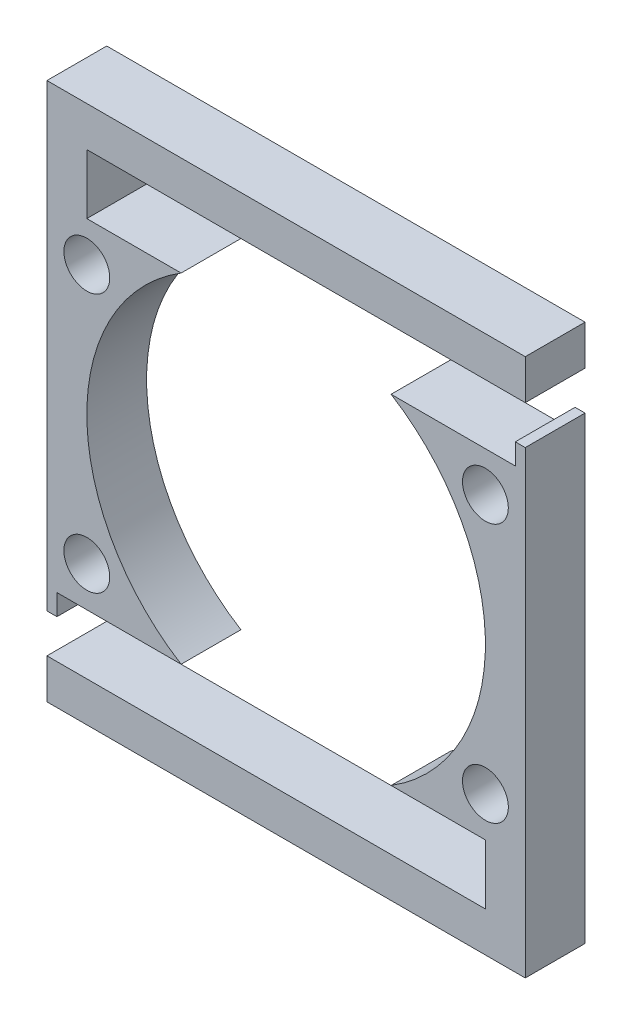
ISO-10303-21;
HEADER;
FILE_DESCRIPTION(('STEP AP214'),'2;1');
FILE_NAME('part.step','',(''),(''),'','','');
FILE_SCHEMA(('AUTOMOTIVE_DESIGN { 1 0 10303 214 1 1 1 1 }'));
ENDSEC;
DATA;
#1=APPLICATION_CONTEXT('core data for automotive mechanical design processes');
#2=APPLICATION_PROTOCOL_DEFINITION('international standard','automotive_design',2000,#1);
#3=PRODUCT_CONTEXT('',#1,'mechanical');
#4=PRODUCT('Part','Part','',(#3));
#5=PRODUCT_RELATED_PRODUCT_CATEGORY('part','',(#4));
#6=PRODUCT_DEFINITION_FORMATION('','',#4);
#7=PRODUCT_DEFINITION_CONTEXT('part definition',#1,'design');
#8=PRODUCT_DEFINITION('design','',#6,#7);
#9=PRODUCT_DEFINITION_SHAPE('','',#8);
#10=(LENGTH_UNIT() NAMED_UNIT(*) SI_UNIT(.MILLI.,.METRE.));
#11=(NAMED_UNIT(*) PLANE_ANGLE_UNIT() SI_UNIT($,.RADIAN.));
#12=(NAMED_UNIT(*) SI_UNIT($,.STERADIAN.) SOLID_ANGLE_UNIT());
#13=UNCERTAINTY_MEASURE_WITH_UNIT(LENGTH_MEASURE(1.E-05),#10,'distance_accuracy_value','');
#14=(GEOMETRIC_REPRESENTATION_CONTEXT(3) GLOBAL_UNCERTAINTY_ASSIGNED_CONTEXT((#13)) GLOBAL_UNIT_ASSIGNED_CONTEXT((#10,
#11,#12)) REPRESENTATION_CONTEXT('',''));
#15=CARTESIAN_POINT('',(0.,0.,0.));
#16=DIRECTION('',(0.,0.,1.));
#17=DIRECTION('',(1.,0.,0.));
#18=AXIS2_PLACEMENT_3D('',#15,#16,#17);
#19=CARTESIAN_POINT('',(0.,0.,3.));
#20=DIRECTION('',(0.,0.,1.));
#21=DIRECTION('',(1.,0.,0.));
#22=AXIS2_PLACEMENT_3D('',#19,#20,#21);
#23=PLANE('',#22);
#24=CARTESIAN_POINT('',(-10.,-6.5,3.));
#25=DIRECTION('',(0.,0.,1.));
#26=DIRECTION('',(1.,0.,0.));
#27=AXIS2_PLACEMENT_3D('',#24,#25,#26);
#28=CIRCLE('',#27,1.15);
#29=CARTESIAN_POINT('',(-8.85,-6.5,3.));
#30=VERTEX_POINT('',#29);
#31=EDGE_CURVE('E165',#30,#30,#28,.T.);
#32=ORIENTED_EDGE('',*,*,#31,.F.);
#33=EDGE_LOOP('',(#32));
#34=FACE_BOUND('',#33,.T.);
#35=DIRECTION('',(0.,1.,0.));
#36=VECTOR('',#35,1.);
#37=CARTESIAN_POINT('',(12.,11.5,3.));
#38=LINE('',#37,#36);
#39=CARTESIAN_POINT('',(12.,11.5,3.));
#40=VERTEX_POINT('',#39);
#41=CARTESIAN_POINT('',(12.,13.5,3.));
#42=VERTEX_POINT('',#41);
#43=EDGE_CURVE('E180',#40,#42,#38,.T.);
#44=ORIENTED_EDGE('',*,*,#43,.T.);
#45=DIRECTION('',(-1.,0.,0.));
#46=VECTOR('',#45,1.);
#47=CARTESIAN_POINT('',(-12.,13.5,3.));
#48=LINE('',#47,#46);
#49=CARTESIAN_POINT('',(-12.,13.5,3.));
#50=VERTEX_POINT('',#49);
#51=EDGE_CURVE('E104',#42,#50,#48,.T.);
#52=ORIENTED_EDGE('',*,*,#51,.T.);
#53=DIRECTION('',(0.,-1.,0.));
#54=VECTOR('',#53,1.);
#55=CARTESIAN_POINT('',(-12.,-8.5,3.));
#56=LINE('',#55,#54);
#57=CARTESIAN_POINT('',(-12.0000000000001,-9.54999999999992,3.));
#58=VERTEX_POINT('',#57);
#59=EDGE_CURVE('E176',#50,#58,#56,.T.);
#60=ORIENTED_EDGE('',*,*,#59,.T.);
#61=DIRECTION('',(1.,0.,0.));
#62=VECTOR('',#61,1.);
#63=CARTESIAN_POINT('',(-12.0000000000001,-9.54999999999992,3.));
#64=LINE('',#63,#62);
#65=CARTESIAN_POINT('',(-11.5000000000001,-9.54999999999992,3.));
#66=VERTEX_POINT('',#65);
#67=EDGE_CURVE('E268',#58,#66,#64,.T.);
#68=ORIENTED_EDGE('',*,*,#67,.T.);
#69=DIRECTION('',(0.,1.,0.));
#70=VECTOR('',#69,1.);
#71=CARTESIAN_POINT('',(-11.5000000000001,-9.54999999999992,3.));
#72=LINE('',#71,#70);
#73=CARTESIAN_POINT('',(-11.5000000000001,-8.49999999999992,3.));
#74=VERTEX_POINT('',#73);
#75=EDGE_CURVE('E266',#66,#74,#72,.T.);
#76=ORIENTED_EDGE('',*,*,#75,.T.);
#77=DIRECTION('',(1.,0.,0.));
#78=VECTOR('',#77,1.);
#79=CARTESIAN_POINT('',(-12.,-8.5,3.));
#80=LINE('',#79,#78);
#81=CARTESIAN_POINT('',(-5.26782687642636,-8.5,3.));
#82=VERTEX_POINT('',#81);
#83=EDGE_CURVE('E174',#74,#82,#80,.T.);
#84=ORIENTED_EDGE('',*,*,#83,.T.);
#85=CARTESIAN_POINT('',(0.,0.,3.));
#86=DIRECTION('',(0.,0.,-1.));
#87=DIRECTION('',(1.,0.,0.));
#88=AXIS2_PLACEMENT_3D('',#85,#86,#87);
#89=CIRCLE('',#88,10.);
#90=CARTESIAN_POINT('',(-5.26782687642637,8.5,3.));
#91=VERTEX_POINT('',#90);
#92=EDGE_CURVE('E145',#82,#91,#89,.T.);
#93=ORIENTED_EDGE('',*,*,#92,.T.);
#94=DIRECTION('',(-1.,0.,0.));
#95=VECTOR('',#94,1.);
#96=CARTESIAN_POINT('',(-10.,8.49999999999999,3.));
#97=LINE('',#96,#95);
#98=CARTESIAN_POINT('',(-10.,8.49999999999999,3.));
#99=VERTEX_POINT('',#98);
#100=EDGE_CURVE('E171',#91,#99,#97,.T.);
#101=ORIENTED_EDGE('',*,*,#100,.T.);
#102=DIRECTION('',(0.,1.,0.));
#103=VECTOR('',#102,1.);
#104=CARTESIAN_POINT('',(-10.,11.5,3.));
#105=LINE('',#104,#103);
#106=CARTESIAN_POINT('',(-10.,11.5,3.));
#107=VERTEX_POINT('',#106);
#108=EDGE_CURVE('E168',#99,#107,#105,.T.);
#109=ORIENTED_EDGE('',*,*,#108,.T.);
#110=DIRECTION('',(1.,0.,0.));
#111=VECTOR('',#110,1.);
#112=CARTESIAN_POINT('',(12.,11.5,3.));
#113=LINE('',#112,#111);
#114=EDGE_CURVE('E166',#107,#40,#113,.T.);
#115=ORIENTED_EDGE('',*,*,#114,.T.);
#116=EDGE_LOOP('',(#44,#52,#60,#68,#76,#84,#93,#101,#109,#115));
#117=FACE_BOUND('',#116,.T.);
#118=CARTESIAN_POINT('',(-10.,6.5,3.));
#119=DIRECTION('',(0.,0.,1.));
#120=DIRECTION('',(-1.,0.,0.));
#121=AXIS2_PLACEMENT_3D('',#118,#119,#120);
#122=CIRCLE('',#121,1.15);
#123=CARTESIAN_POINT('',(-11.15,6.5,3.));
#124=VERTEX_POINT('',#123);
#125=EDGE_CURVE('E55',#124,#124,#122,.T.);
#126=ORIENTED_EDGE('',*,*,#125,.F.);
#127=EDGE_LOOP('',(#126));
#128=FACE_BOUND('',#127,.T.);
#129=ADVANCED_FACE('F51',(#34,#117,#128),#23,.T.);
#130=CARTESIAN_POINT('',(0.,0.,0.));
#131=DIRECTION('',(0.,0.,1.));
#132=DIRECTION('',(1.,0.,0.));
#133=AXIS2_PLACEMENT_3D('',#130,#131,#132);
#134=PLANE('',#133);
#135=DIRECTION('',(0.,1.,0.));
#136=VECTOR('',#135,1.);
#137=CARTESIAN_POINT('',(12.,11.5,0.));
#138=LINE('',#137,#136);
#139=CARTESIAN_POINT('',(12.,11.5,0.));
#140=VERTEX_POINT('',#139);
#141=CARTESIAN_POINT('',(12.,13.5,0.));
#142=VERTEX_POINT('',#141);
#143=EDGE_CURVE('E162',#140,#142,#138,.T.);
#144=ORIENTED_EDGE('',*,*,#143,.F.);
#145=DIRECTION('',(1.,0.,0.));
#146=VECTOR('',#145,1.);
#147=CARTESIAN_POINT('',(12.,11.5,0.));
#148=LINE('',#147,#146);
#149=CARTESIAN_POINT('',(-10.,11.5,0.));
#150=VERTEX_POINT('',#149);
#151=EDGE_CURVE('E113',#150,#140,#148,.T.);
#152=ORIENTED_EDGE('',*,*,#151,.F.);
#153=DIRECTION('',(0.,1.,0.));
#154=VECTOR('',#153,1.);
#155=CARTESIAN_POINT('',(-10.,11.5,0.));
#156=LINE('',#155,#154);
#157=CARTESIAN_POINT('',(-10.,8.49999999999999,0.));
#158=VERTEX_POINT('',#157);
#159=EDGE_CURVE('E155',#158,#150,#156,.T.);
#160=ORIENTED_EDGE('',*,*,#159,.F.);
#161=DIRECTION('',(-1.,0.,0.));
#162=VECTOR('',#161,1.);
#163=CARTESIAN_POINT('',(-10.,8.49999999999999,0.));
#164=LINE('',#163,#162);
#165=CARTESIAN_POINT('',(-5.26782687642637,8.5,0.));
#166=VERTEX_POINT('',#165);
#167=EDGE_CURVE('E153',#166,#158,#164,.T.);
#168=ORIENTED_EDGE('',*,*,#167,.F.);
#169=CARTESIAN_POINT('',(0.,0.,0.));
#170=DIRECTION('',(0.,0.,-1.));
#171=DIRECTION('',(1.,0.,0.));
#172=AXIS2_PLACEMENT_3D('',#169,#170,#171);
#173=CIRCLE('',#172,10.);
#174=CARTESIAN_POINT('',(-5.26782687642636,-8.5,0.));
#175=VERTEX_POINT('',#174);
#176=EDGE_CURVE('E139',#175,#166,#173,.T.);
#177=ORIENTED_EDGE('',*,*,#176,.F.);
#178=DIRECTION('',(1.,0.,0.));
#179=VECTOR('',#178,1.);
#180=CARTESIAN_POINT('',(-12.,-8.5,0.));
#181=LINE('',#180,#179);
#182=CARTESIAN_POINT('',(-11.5000000000001,-8.5,0.));
#183=VERTEX_POINT('',#182);
#184=EDGE_CURVE('E130',#183,#175,#181,.T.);
#185=ORIENTED_EDGE('',*,*,#184,.F.);
#186=DIRECTION('',(0.,1.,0.));
#187=VECTOR('',#186,1.);
#188=CARTESIAN_POINT('',(-11.5000000000001,-9.54999999999992,0.));
#189=LINE('',#188,#187);
#190=CARTESIAN_POINT('',(-11.5000000000001,-9.54999999999992,0.));
#191=VERTEX_POINT('',#190);
#192=EDGE_CURVE('E66',#191,#183,#189,.T.);
#193=ORIENTED_EDGE('',*,*,#192,.F.);
#194=DIRECTION('',(1.,0.,0.));
#195=VECTOR('',#194,1.);
#196=CARTESIAN_POINT('',(-12.0000000000001,-9.54999999999992,0.));
#197=LINE('',#196,#195);
#198=CARTESIAN_POINT('',(-12.0000000000001,-9.54999999999992,0.));
#199=VERTEX_POINT('',#198);
#200=EDGE_CURVE('E255',#199,#191,#197,.T.);
#201=ORIENTED_EDGE('',*,*,#200,.F.);
#202=DIRECTION('',(0.,-1.,0.));
#203=VECTOR('',#202,1.);
#204=CARTESIAN_POINT('',(-12.,-8.5,0.));
#205=LINE('',#204,#203);
#206=CARTESIAN_POINT('',(-12.,13.5,0.));
#207=VERTEX_POINT('',#206);
#208=EDGE_CURVE('E138',#207,#199,#205,.T.);
#209=ORIENTED_EDGE('',*,*,#208,.F.);
#210=DIRECTION('',(-1.,0.,0.));
#211=VECTOR('',#210,1.);
#212=CARTESIAN_POINT('',(-12.,13.5,0.));
#213=LINE('',#212,#211);
#214=EDGE_CURVE('E75',#142,#207,#213,.T.);
#215=ORIENTED_EDGE('',*,*,#214,.F.);
#216=EDGE_LOOP('',(#144,#152,#160,#168,#177,#185,#193,#201,#209,#215));
#217=FACE_BOUND('',#216,.T.);
#218=CARTESIAN_POINT('',(-10.,-6.5,0.));
#219=DIRECTION('',(0.,0.,1.));
#220=DIRECTION('',(1.,0.,0.));
#221=AXIS2_PLACEMENT_3D('',#218,#219,#220);
#222=CIRCLE('',#221,1.15);
#223=CARTESIAN_POINT('',(-8.85,-6.5,0.));
#224=VERTEX_POINT('',#223);
#225=EDGE_CURVE('E182',#224,#224,#222,.T.);
#226=ORIENTED_EDGE('',*,*,#225,.T.);
#227=EDGE_LOOP('',(#226));
#228=FACE_BOUND('',#227,.T.);
#229=CARTESIAN_POINT('',(-10.,6.5,0.));
#230=DIRECTION('',(0.,0.,1.));
#231=DIRECTION('',(-1.,0.,0.));
#232=AXIS2_PLACEMENT_3D('',#229,#230,#231);
#233=CIRCLE('',#232,1.15);
#234=CARTESIAN_POINT('',(-11.15,6.5,0.));
#235=VERTEX_POINT('',#234);
#236=EDGE_CURVE('E12',#235,#235,#233,.T.);
#237=ORIENTED_EDGE('',*,*,#236,.T.);
#238=EDGE_LOOP('',(#237));
#239=FACE_BOUND('',#238,.T.);
#240=ADVANCED_FACE('F150',(#217,#228,#239),#134,.F.);
#241=CARTESIAN_POINT('',(12.,11.5,3.));
#242=DIRECTION('',(-1.,0.,0.));
#243=DIRECTION('',(0.,0.,1.));
#244=AXIS2_PLACEMENT_3D('',#241,#242,#243);
#245=PLANE('',#244);
#246=ORIENTED_EDGE('',*,*,#143,.T.);
#247=DIRECTION('',(0.,0.,-1.));
#248=VECTOR('',#247,1.);
#249=CARTESIAN_POINT('',(12.,13.5,3.));
#250=LINE('',#249,#248);
#251=EDGE_CURVE('E263',#42,#142,#250,.T.);
#252=ORIENTED_EDGE('',*,*,#251,.F.);
#253=ORIENTED_EDGE('',*,*,#43,.F.);
#254=DIRECTION('',(0.,0.,-1.));
#255=VECTOR('',#254,1.);
#256=CARTESIAN_POINT('',(12.,11.5,3.));
#257=LINE('',#256,#255);
#258=EDGE_CURVE('E169',#40,#140,#257,.T.);
#259=ORIENTED_EDGE('',*,*,#258,.T.);
#260=EDGE_LOOP('',(#246,#252,#253,#259));
#261=FACE_BOUND('',#260,.T.);
#262=ADVANCED_FACE('F206',(#261),#245,.F.);
#263=CARTESIAN_POINT('',(-12.,13.5,3.));
#264=DIRECTION('',(0.,-1.,0.));
#265=DIRECTION('',(0.,0.,-1.));
#266=AXIS2_PLACEMENT_3D('',#263,#264,#265);
#267=PLANE('',#266);
#268=ORIENTED_EDGE('',*,*,#214,.T.);
#269=DIRECTION('',(0.,0.,-1.));
#270=VECTOR('',#269,1.);
#271=CARTESIAN_POINT('',(-12.,13.5,3.));
#272=LINE('',#271,#270);
#273=EDGE_CURVE('E147',#50,#207,#272,.T.);
#274=ORIENTED_EDGE('',*,*,#273,.F.);
#275=ORIENTED_EDGE('',*,*,#51,.F.);
#276=ORIENTED_EDGE('',*,*,#251,.T.);
#277=EDGE_LOOP('',(#268,#274,#275,#276));
#278=FACE_BOUND('',#277,.T.);
#279=ADVANCED_FACE('F212',(#278),#267,.F.);
#280=CARTESIAN_POINT('',(-12.,-8.5,3.));
#281=DIRECTION('',(1.,0.,0.));
#282=DIRECTION('',(0.,1.,0.));
#283=AXIS2_PLACEMENT_3D('',#280,#281,#282);
#284=PLANE('',#283);
#285=ORIENTED_EDGE('',*,*,#208,.T.);
#286=DIRECTION('',(0.,0.,-1.));
#287=VECTOR('',#286,1.);
#288=CARTESIAN_POINT('',(-12.0000000000001,-9.54999999999992,3.));
#289=LINE('',#288,#287);
#290=EDGE_CURVE('E261',#58,#199,#289,.T.);
#291=ORIENTED_EDGE('',*,*,#290,.F.);
#292=ORIENTED_EDGE('',*,*,#59,.F.);
#293=ORIENTED_EDGE('',*,*,#273,.T.);
#294=EDGE_LOOP('',(#285,#291,#292,#293));
#295=FACE_BOUND('',#294,.T.);
#296=ADVANCED_FACE('F238',(#295),#284,.F.);
#297=CARTESIAN_POINT('',(-12.,-8.5,3.));
#298=DIRECTION('',(0.,1.,0.));
#299=DIRECTION('',(0.,0.,1.));
#300=AXIS2_PLACEMENT_3D('',#297,#298,#299);
#301=PLANE('',#300);
#302=ORIENTED_EDGE('',*,*,#83,.F.);
#303=DIRECTION('',(0.,0.,-1.));
#304=VECTOR('',#303,1.);
#305=CARTESIAN_POINT('',(-11.5000000000001,-8.49999999999992,3.));
#306=LINE('',#305,#304);
#307=EDGE_CURVE('E136',#74,#183,#306,.T.);
#308=ORIENTED_EDGE('',*,*,#307,.T.);
#309=ORIENTED_EDGE('',*,*,#184,.T.);
#310=DIRECTION('',(0.,0.,-1.));
#311=VECTOR('',#310,1.);
#312=CARTESIAN_POINT('',(-5.26782687642636,-8.5,3.));
#313=LINE('',#312,#311);
#314=EDGE_CURVE('E134',#82,#175,#313,.T.);
#315=ORIENTED_EDGE('',*,*,#314,.F.);
#316=EDGE_LOOP('',(#302,#308,#309,#315));
#317=FACE_BOUND('',#316,.T.);
#318=ADVANCED_FACE('F133',(#317),#301,.F.);
#319=CARTESIAN_POINT('',(0.,0.,3.));
#320=DIRECTION('',(0.,0.,-1.));
#321=DIRECTION('',(-1.,0.,0.));
#322=AXIS2_PLACEMENT_3D('',#319,#320,#321);
#323=CYLINDRICAL_SURFACE('',#322,10.);
#324=ORIENTED_EDGE('',*,*,#176,.T.);
#325=DIRECTION('',(0.,0.,-1.));
#326=VECTOR('',#325,1.);
#327=CARTESIAN_POINT('',(-5.26782687642637,8.5,3.));
#328=LINE('',#327,#326);
#329=EDGE_CURVE('E146',#91,#166,#328,.T.);
#330=ORIENTED_EDGE('',*,*,#329,.F.);
#331=ORIENTED_EDGE('',*,*,#92,.F.);
#332=ORIENTED_EDGE('',*,*,#314,.T.);
#333=EDGE_LOOP('',(#324,#330,#331,#332));
#334=FACE_BOUND('',#333,.T.);
#335=ADVANCED_FACE('F142',(#334),#323,.F.);
#336=CARTESIAN_POINT('',(-10.,8.49999999999999,3.));
#337=DIRECTION('',(0.,-1.,0.));
#338=DIRECTION('',(1.,0.,0.));
#339=AXIS2_PLACEMENT_3D('',#336,#337,#338);
#340=PLANE('',#339);
#341=ORIENTED_EDGE('',*,*,#167,.T.);
#342=DIRECTION('',(0.,0.,-1.));
#343=VECTOR('',#342,1.);
#344=CARTESIAN_POINT('',(-10.,8.49999999999999,3.));
#345=LINE('',#344,#343);
#346=EDGE_CURVE('E279',#99,#158,#345,.T.);
#347=ORIENTED_EDGE('',*,*,#346,.F.);
#348=ORIENTED_EDGE('',*,*,#100,.F.);
#349=ORIENTED_EDGE('',*,*,#329,.T.);
#350=EDGE_LOOP('',(#341,#347,#348,#349));
#351=FACE_BOUND('',#350,.T.);
#352=ADVANCED_FACE('F226',(#351),#340,.F.);
#353=CARTESIAN_POINT('',(-10.,11.5,3.));
#354=DIRECTION('',(-1.,0.,0.));
#355=DIRECTION('',(0.,-1.,0.));
#356=AXIS2_PLACEMENT_3D('',#353,#354,#355);
#357=PLANE('',#356);
#358=ORIENTED_EDGE('',*,*,#159,.T.);
#359=DIRECTION('',(0.,0.,-1.));
#360=VECTOR('',#359,1.);
#361=CARTESIAN_POINT('',(-10.,11.5,3.));
#362=LINE('',#361,#360);
#363=EDGE_CURVE('E282',#107,#150,#362,.T.);
#364=ORIENTED_EDGE('',*,*,#363,.F.);
#365=ORIENTED_EDGE('',*,*,#108,.F.);
#366=ORIENTED_EDGE('',*,*,#346,.T.);
#367=EDGE_LOOP('',(#358,#364,#365,#366));
#368=FACE_BOUND('',#367,.T.);
#369=ADVANCED_FACE('F222',(#368),#357,.F.);
#370=CARTESIAN_POINT('',(12.,11.5,3.));
#371=DIRECTION('',(0.,1.,0.));
#372=DIRECTION('',(-1.,0.,0.));
#373=AXIS2_PLACEMENT_3D('',#370,#371,#372);
#374=PLANE('',#373);
#375=ORIENTED_EDGE('',*,*,#151,.T.);
#376=ORIENTED_EDGE('',*,*,#258,.F.);
#377=ORIENTED_EDGE('',*,*,#114,.F.);
#378=ORIENTED_EDGE('',*,*,#363,.T.);
#379=EDGE_LOOP('',(#375,#376,#377,#378));
#380=FACE_BOUND('',#379,.T.);
#381=ADVANCED_FACE('F216',(#380),#374,.F.);
#382=CARTESIAN_POINT('',(-10.,-6.5,3.));
#383=DIRECTION('',(0.,0.,-1.));
#384=DIRECTION('',(-1.,0.,0.));
#385=AXIS2_PLACEMENT_3D('',#382,#383,#384);
#386=CYLINDRICAL_SURFACE('',#385,1.15);
#387=ORIENTED_EDGE('',*,*,#31,.T.);
#388=EDGE_LOOP('',(#387));
#389=FACE_BOUND('',#388,.T.);
#390=ORIENTED_EDGE('',*,*,#225,.F.);
#391=EDGE_LOOP('',(#390));
#392=FACE_BOUND('',#391,.T.);
#393=ADVANCED_FACE('F188',(#389,#392),#386,.F.);
#394=CARTESIAN_POINT('',(-10.,6.5,3.));
#395=DIRECTION('',(0.,0.,-1.));
#396=DIRECTION('',(-1.,0.,0.));
#397=AXIS2_PLACEMENT_3D('',#394,#395,#396);
#398=CYLINDRICAL_SURFACE('',#397,1.15);
#399=ORIENTED_EDGE('',*,*,#125,.T.);
#400=EDGE_LOOP('',(#399));
#401=FACE_BOUND('',#400,.T.);
#402=ORIENTED_EDGE('',*,*,#236,.F.);
#403=EDGE_LOOP('',(#402));
#404=FACE_BOUND('',#403,.T.);
#405=ADVANCED_FACE('F53',(#401,#404),#398,.F.);
#406=CARTESIAN_POINT('',(-12.0000000000001,-9.54999999999992,3.));
#407=DIRECTION('',(0.,1.,0.));
#408=DIRECTION('',(-1.,0.,0.));
#409=AXIS2_PLACEMENT_3D('',#406,#407,#408);
#410=PLANE('',#409);
#411=ORIENTED_EDGE('',*,*,#200,.T.);
#412=DIRECTION('',(0.,0.,-1.));
#413=VECTOR('',#412,1.);
#414=CARTESIAN_POINT('',(-11.5000000000001,-9.54999999999992,3.));
#415=LINE('',#414,#413);
#416=EDGE_CURVE('E258',#66,#191,#415,.T.);
#417=ORIENTED_EDGE('',*,*,#416,.F.);
#418=ORIENTED_EDGE('',*,*,#67,.F.);
#419=ORIENTED_EDGE('',*,*,#290,.T.);
#420=EDGE_LOOP('',(#411,#417,#418,#419));
#421=FACE_BOUND('',#420,.T.);
#422=ADVANCED_FACE('F202',(#421),#410,.F.);
#423=CARTESIAN_POINT('',(-11.5000000000001,-9.54999999999992,3.));
#424=DIRECTION('',(-1.,0.,0.));
#425=DIRECTION('',(0.,-1.,0.));
#426=AXIS2_PLACEMENT_3D('',#423,#424,#425);
#427=PLANE('',#426);
#428=ORIENTED_EDGE('',*,*,#192,.T.);
#429=ORIENTED_EDGE('',*,*,#307,.F.);
#430=ORIENTED_EDGE('',*,*,#75,.F.);
#431=ORIENTED_EDGE('',*,*,#416,.T.);
#432=EDGE_LOOP('',(#428,#429,#430,#431));
#433=FACE_BOUND('',#432,.T.);
#434=ADVANCED_FACE('F243',(#433),#427,.F.);
#435=CLOSED_SHELL('',(#129,#240,#262,#279,#296,#318,#335,#352,#369,#381,#393,#405,#422,#434));
#436=MANIFOLD_SOLID_BREP('B2',#435);
#437=CARTESIAN_POINT('',(0.,0.,3.));
#438=DIRECTION('',(0.,0.,1.));
#439=DIRECTION('',(1.,0.,0.));
#440=AXIS2_PLACEMENT_3D('',#437,#438,#439);
#441=PLANE('',#440);
#442=CARTESIAN_POINT('',(10.,-6.5,3.));
#443=DIRECTION('',(0.,0.,1.));
#444=DIRECTION('',(-1.,0.,0.));
#445=AXIS2_PLACEMENT_3D('',#442,#443,#444);
#446=CIRCLE('',#445,1.15);
#447=CARTESIAN_POINT('',(8.85,-6.5,3.));
#448=VERTEX_POINT('',#447);
#449=EDGE_CURVE('E489',#448,#448,#446,.T.);
#450=ORIENTED_EDGE('',*,*,#449,.F.);
#451=EDGE_LOOP('',(#450));
#452=FACE_BOUND('',#451,.T.);
#453=DIRECTION('',(0.,-1.,0.));
#454=VECTOR('',#453,1.);
#455=CARTESIAN_POINT('',(-12.,-13.5,3.));
#456=LINE('',#455,#454);
#457=CARTESIAN_POINT('',(-12.,-11.5,3.));
#458=VERTEX_POINT('',#457);
#459=CARTESIAN_POINT('',(-12.,-13.5,3.));
#460=VERTEX_POINT('',#459);
#461=EDGE_CURVE('E502',#458,#460,#456,.T.);
#462=ORIENTED_EDGE('',*,*,#461,.T.);
#463=DIRECTION('',(1.,0.,0.));
#464=VECTOR('',#463,1.);
#465=CARTESIAN_POINT('',(-12.,-13.5,3.));
#466=LINE('',#465,#464);
#467=CARTESIAN_POINT('',(12.,-13.5,3.));
#468=VERTEX_POINT('',#467);
#469=EDGE_CURVE('E444',#460,#468,#466,.T.);
#470=ORIENTED_EDGE('',*,*,#469,.T.);
#471=DIRECTION('',(0.,1.,0.));
#472=VECTOR('',#471,1.);
#473=CARTESIAN_POINT('',(12.,-13.5,3.));
#474=LINE('',#473,#472);
#475=CARTESIAN_POINT('',(12.,9.55,3.));
#476=VERTEX_POINT('',#475);
#477=EDGE_CURVE('E517',#468,#476,#474,.T.);
#478=ORIENTED_EDGE('',*,*,#477,.T.);
#479=DIRECTION('',(-1.,0.,0.));
#480=VECTOR('',#479,1.);
#481=CARTESIAN_POINT('',(12.,9.55,3.));
#482=LINE('',#481,#480);
#483=CARTESIAN_POINT('',(11.5,9.55,3.));
#484=VERTEX_POINT('',#483);
#485=EDGE_CURVE('E529',#476,#484,#482,.T.);
#486=ORIENTED_EDGE('',*,*,#485,.T.);
#487=DIRECTION('',(0.,-1.,0.));
#488=VECTOR('',#487,1.);
#489=CARTESIAN_POINT('',(11.5,9.55,3.));
#490=LINE('',#489,#488);
#491=CARTESIAN_POINT('',(11.5,8.5,3.));
#492=VERTEX_POINT('',#491);
#493=EDGE_CURVE('E532',#484,#492,#490,.T.);
#494=ORIENTED_EDGE('',*,*,#493,.T.);
#495=DIRECTION('',(-1.,0.,0.));
#496=VECTOR('',#495,1.);
#497=CARTESIAN_POINT('',(5.26782687642637,8.5,3.));
#498=LINE('',#497,#496);
#499=CARTESIAN_POINT('',(5.26782687642637,8.5,3.));
#500=VERTEX_POINT('',#499);
#501=EDGE_CURVE('E555',#492,#500,#498,.T.);
#502=ORIENTED_EDGE('',*,*,#501,.T.);
#503=CARTESIAN_POINT('',(0.,0.,3.));
#504=DIRECTION('',(0.,0.,-1.));
#505=DIRECTION('',(1.,0.,0.));
#506=AXIS2_PLACEMENT_3D('',#503,#504,#505);
#507=CIRCLE('',#506,10.);
#508=CARTESIAN_POINT('',(5.26782687642636,-8.5,3.));
#509=VERTEX_POINT('',#508);
#510=EDGE_CURVE('E464',#500,#509,#507,.T.);
#511=ORIENTED_EDGE('',*,*,#510,.T.);
#512=DIRECTION('',(1.,0.,0.));
#513=VECTOR('',#512,1.);
#514=CARTESIAN_POINT('',(10.,-8.5,3.));
#515=LINE('',#514,#513);
#516=CARTESIAN_POINT('',(10.,-8.5,3.));
#517=VERTEX_POINT('',#516);
#518=EDGE_CURVE('E457',#509,#517,#515,.T.);
#519=ORIENTED_EDGE('',*,*,#518,.T.);
#520=DIRECTION('',(0.,-1.,0.));
#521=VECTOR('',#520,1.);
#522=CARTESIAN_POINT('',(10.,-11.5,3.));
#523=LINE('',#522,#521);
#524=CARTESIAN_POINT('',(10.,-11.5,3.));
#525=VERTEX_POINT('',#524);
#526=EDGE_CURVE('E461',#517,#525,#523,.T.);
#527=ORIENTED_EDGE('',*,*,#526,.T.);
#528=DIRECTION('',(-1.,0.,0.));
#529=VECTOR('',#528,1.);
#530=CARTESIAN_POINT('',(-12.,-11.5,3.));
#531=LINE('',#530,#529);
#532=EDGE_CURVE('E406',#525,#458,#531,.T.);
#533=ORIENTED_EDGE('',*,*,#532,.T.);
#534=EDGE_LOOP('',(#462,#470,#478,#486,#494,#502,#511,#519,#527,#533));
#535=FACE_BOUND('',#534,.T.);
#536=CARTESIAN_POINT('',(10.,6.5,3.));
#537=DIRECTION('',(0.,0.,1.));
#538=DIRECTION('',(1.,0.,0.));
#539=AXIS2_PLACEMENT_3D('',#536,#537,#538);
#540=CIRCLE('',#539,1.15);
#541=CARTESIAN_POINT('',(11.15,6.5,3.));
#542=VERTEX_POINT('',#541);
#543=EDGE_CURVE('E542',#542,#542,#540,.T.);
#544=ORIENTED_EDGE('',*,*,#543,.F.);
#545=EDGE_LOOP('',(#544));
#546=FACE_BOUND('',#545,.T.);
#547=ADVANCED_FACE('F382',(#452,#535,#546),#441,.T.);
#548=CARTESIAN_POINT('',(0.,0.,0.));
#549=DIRECTION('',(0.,0.,1.));
#550=DIRECTION('',(1.,0.,0.));
#551=AXIS2_PLACEMENT_3D('',#548,#549,#550);
#552=PLANE('',#551);
#553=DIRECTION('',(0.,-1.,0.));
#554=VECTOR('',#553,1.);
#555=CARTESIAN_POINT('',(-12.,-13.5,0.));
#556=LINE('',#555,#554);
#557=CARTESIAN_POINT('',(-12.,-11.5,0.));
#558=VERTEX_POINT('',#557);
#559=CARTESIAN_POINT('',(-12.,-13.5,0.));
#560=VERTEX_POINT('',#559);
#561=EDGE_CURVE('E485',#558,#560,#556,.T.);
#562=ORIENTED_EDGE('',*,*,#561,.F.);
#563=DIRECTION('',(-1.,0.,0.));
#564=VECTOR('',#563,1.);
#565=CARTESIAN_POINT('',(-12.,-11.5,0.));
#566=LINE('',#565,#564);
#567=CARTESIAN_POINT('',(10.,-11.5,0.));
#568=VERTEX_POINT('',#567);
#569=EDGE_CURVE('E436',#568,#558,#566,.T.);
#570=ORIENTED_EDGE('',*,*,#569,.F.);
#571=DIRECTION('',(0.,-1.,0.));
#572=VECTOR('',#571,1.);
#573=CARTESIAN_POINT('',(10.,-11.5,0.));
#574=LINE('',#573,#572);
#575=CARTESIAN_POINT('',(10.,-8.5,0.));
#576=VERTEX_POINT('',#575);
#577=EDGE_CURVE('E499',#576,#568,#574,.T.);
#578=ORIENTED_EDGE('',*,*,#577,.F.);
#579=DIRECTION('',(1.,0.,0.));
#580=VECTOR('',#579,1.);
#581=CARTESIAN_POINT('',(10.,-8.5,0.));
#582=LINE('',#581,#580);
#583=CARTESIAN_POINT('',(5.26782687642636,-8.5,0.));
#584=VERTEX_POINT('',#583);
#585=EDGE_CURVE('E473',#584,#576,#582,.T.);
#586=ORIENTED_EDGE('',*,*,#585,.F.);
#587=CARTESIAN_POINT('',(0.,0.,0.));
#588=DIRECTION('',(0.,0.,-1.));
#589=DIRECTION('',(1.,0.,0.));
#590=AXIS2_PLACEMENT_3D('',#587,#588,#589);
#591=CIRCLE('',#590,10.);
#592=CARTESIAN_POINT('',(5.26782687642637,8.5,0.));
#593=VERTEX_POINT('',#592);
#594=EDGE_CURVE('E496',#593,#584,#591,.T.);
#595=ORIENTED_EDGE('',*,*,#594,.F.);
#596=DIRECTION('',(-1.,0.,0.));
#597=VECTOR('',#596,1.);
#598=CARTESIAN_POINT('',(5.26782687642637,8.5,0.));
#599=LINE('',#598,#597);
#600=CARTESIAN_POINT('',(11.5,8.5,0.));
#601=VERTEX_POINT('',#600);
#602=EDGE_CURVE('E494',#601,#593,#599,.T.);
#603=ORIENTED_EDGE('',*,*,#602,.F.);
#604=DIRECTION('',(0.,-1.,0.));
#605=VECTOR('',#604,1.);
#606=CARTESIAN_POINT('',(11.5,9.55,0.));
#607=LINE('',#606,#605);
#608=CARTESIAN_POINT('',(11.5,9.55,0.));
#609=VERTEX_POINT('',#608);
#610=EDGE_CURVE('E397',#609,#601,#607,.T.);
#611=ORIENTED_EDGE('',*,*,#610,.F.);
#612=DIRECTION('',(-1.,0.,0.));
#613=VECTOR('',#612,1.);
#614=CARTESIAN_POINT('',(12.,9.55,0.));
#615=LINE('',#614,#613);
#616=CARTESIAN_POINT('',(12.,9.55,0.));
#617=VERTEX_POINT('',#616);
#618=EDGE_CURVE('E524',#617,#609,#615,.T.);
#619=ORIENTED_EDGE('',*,*,#618,.F.);
#620=DIRECTION('',(0.,1.,0.));
#621=VECTOR('',#620,1.);
#622=CARTESIAN_POINT('',(12.,-13.5,0.));
#623=LINE('',#622,#621);
#624=CARTESIAN_POINT('',(12.,-13.5,0.));
#625=VERTEX_POINT('',#624);
#626=EDGE_CURVE('E491',#625,#617,#623,.T.);
#627=ORIENTED_EDGE('',*,*,#626,.F.);
#628=DIRECTION('',(1.,0.,0.));
#629=VECTOR('',#628,1.);
#630=CARTESIAN_POINT('',(-12.,-13.5,0.));
#631=LINE('',#630,#629);
#632=EDGE_CURVE('E488',#560,#625,#631,.T.);
#633=ORIENTED_EDGE('',*,*,#632,.F.);
#634=EDGE_LOOP('',(#562,#570,#578,#586,#595,#603,#611,#619,#627,#633));
#635=FACE_BOUND('',#634,.T.);
#636=CARTESIAN_POINT('',(10.,-6.5,0.));
#637=DIRECTION('',(0.,0.,1.));
#638=DIRECTION('',(-1.,0.,0.));
#639=AXIS2_PLACEMENT_3D('',#636,#637,#638);
#640=CIRCLE('',#639,1.15);
#641=CARTESIAN_POINT('',(8.85,-6.5,0.));
#642=VERTEX_POINT('',#641);
#643=EDGE_CURVE('E545',#642,#642,#640,.T.);
#644=ORIENTED_EDGE('',*,*,#643,.T.);
#645=EDGE_LOOP('',(#644));
#646=FACE_BOUND('',#645,.T.);
#647=CARTESIAN_POINT('',(10.,6.5,0.));
#648=DIRECTION('',(0.,0.,1.));
#649=DIRECTION('',(1.,0.,0.));
#650=AXIS2_PLACEMENT_3D('',#647,#648,#649);
#651=CIRCLE('',#650,1.15);
#652=CARTESIAN_POINT('',(11.15,6.5,0.));
#653=VERTEX_POINT('',#652);
#654=EDGE_CURVE('E541',#653,#653,#651,.T.);
#655=ORIENTED_EDGE('',*,*,#654,.T.);
#656=EDGE_LOOP('',(#655));
#657=FACE_BOUND('',#656,.T.);
#658=ADVANCED_FACE('F521',(#635,#646,#657),#552,.F.);
#659=CARTESIAN_POINT('',(-12.,-13.5,3.));
#660=DIRECTION('',(1.,0.,0.));
#661=DIRECTION('',(0.,0.,-1.));
#662=AXIS2_PLACEMENT_3D('',#659,#660,#661);
#663=PLANE('',#662);
#664=ORIENTED_EDGE('',*,*,#561,.T.);
#665=DIRECTION('',(0.,0.,-1.));
#666=VECTOR('',#665,1.);
#667=CARTESIAN_POINT('',(-12.,-13.5,3.));
#668=LINE('',#667,#666);
#669=EDGE_CURVE('E49',#460,#560,#668,.T.);
#670=ORIENTED_EDGE('',*,*,#669,.F.);
#671=ORIENTED_EDGE('',*,*,#461,.F.);
#672=DIRECTION('',(0.,0.,-1.));
#673=VECTOR('',#672,1.);
#674=CARTESIAN_POINT('',(-12.,-11.5,3.));
#675=LINE('',#674,#673);
#676=EDGE_CURVE('E481',#458,#558,#675,.T.);
#677=ORIENTED_EDGE('',*,*,#676,.T.);
#678=EDGE_LOOP('',(#664,#670,#671,#677));
#679=FACE_BOUND('',#678,.T.);
#680=ADVANCED_FACE('F384',(#679),#663,.F.);
#681=CARTESIAN_POINT('',(-12.,-13.5,3.));
#682=DIRECTION('',(0.,1.,0.));
#683=DIRECTION('',(0.,0.,1.));
#684=AXIS2_PLACEMENT_3D('',#681,#682,#683);
#685=PLANE('',#684);
#686=ORIENTED_EDGE('',*,*,#632,.T.);
#687=DIRECTION('',(0.,0.,-1.));
#688=VECTOR('',#687,1.);
#689=CARTESIAN_POINT('',(12.,-13.5,3.));
#690=LINE('',#689,#688);
#691=EDGE_CURVE('E390',#468,#625,#690,.T.);
#692=ORIENTED_EDGE('',*,*,#691,.F.);
#693=ORIENTED_EDGE('',*,*,#469,.F.);
#694=ORIENTED_EDGE('',*,*,#669,.T.);
#695=EDGE_LOOP('',(#686,#692,#693,#694));
#696=FACE_BOUND('',#695,.T.);
#697=ADVANCED_FACE('F609',(#696),#685,.F.);
#698=CARTESIAN_POINT('',(12.,-13.5,3.));
#699=DIRECTION('',(-1.,0.,0.));
#700=DIRECTION('',(0.,0.,1.));
#701=AXIS2_PLACEMENT_3D('',#698,#699,#700);
#702=PLANE('',#701);
#703=ORIENTED_EDGE('',*,*,#626,.T.);
#704=DIRECTION('',(0.,0.,-1.));
#705=VECTOR('',#704,1.);
#706=CARTESIAN_POINT('',(12.,9.55,3.));
#707=LINE('',#706,#705);
#708=EDGE_CURVE('E539',#476,#617,#707,.T.);
#709=ORIENTED_EDGE('',*,*,#708,.F.);
#710=ORIENTED_EDGE('',*,*,#477,.F.);
#711=ORIENTED_EDGE('',*,*,#691,.T.);
#712=EDGE_LOOP('',(#703,#709,#710,#711));
#713=FACE_BOUND('',#712,.T.);
#714=ADVANCED_FACE('F512',(#713),#702,.F.);
#715=CARTESIAN_POINT('',(5.26782687642637,8.5,3.));
#716=DIRECTION('',(0.,-1.,0.));
#717=DIRECTION('',(0.,0.,-1.));
#718=AXIS2_PLACEMENT_3D('',#715,#716,#717);
#719=PLANE('',#718);
#720=ORIENTED_EDGE('',*,*,#501,.F.);
#721=DIRECTION('',(0.,0.,-1.));
#722=VECTOR('',#721,1.);
#723=CARTESIAN_POINT('',(11.5,8.5,3.));
#724=LINE('',#723,#722);
#725=EDGE_CURVE('E535',#492,#601,#724,.T.);
#726=ORIENTED_EDGE('',*,*,#725,.T.);
#727=ORIENTED_EDGE('',*,*,#602,.T.);
#728=DIRECTION('',(0.,0.,-1.));
#729=VECTOR('',#728,1.);
#730=CARTESIAN_POINT('',(5.26782687642637,8.5,3.));
#731=LINE('',#730,#729);
#732=EDGE_CURVE('E506',#500,#593,#731,.T.);
#733=ORIENTED_EDGE('',*,*,#732,.F.);
#734=EDGE_LOOP('',(#720,#726,#727,#733));
#735=FACE_BOUND('',#734,.T.);
#736=ADVANCED_FACE('F562',(#735),#719,.F.);
#737=CARTESIAN_POINT('',(0.,0.,3.));
#738=DIRECTION('',(0.,0.,-1.));
#739=DIRECTION('',(-1.,0.,0.));
#740=AXIS2_PLACEMENT_3D('',#737,#738,#739);
#741=CYLINDRICAL_SURFACE('',#740,10.);
#742=ORIENTED_EDGE('',*,*,#594,.T.);
#743=DIRECTION('',(0.,0.,-1.));
#744=VECTOR('',#743,1.);
#745=CARTESIAN_POINT('',(5.26782687642636,-8.5,3.));
#746=LINE('',#745,#744);
#747=EDGE_CURVE('E476',#509,#584,#746,.T.);
#748=ORIENTED_EDGE('',*,*,#747,.F.);
#749=ORIENTED_EDGE('',*,*,#510,.F.);
#750=ORIENTED_EDGE('',*,*,#732,.T.);
#751=EDGE_LOOP('',(#742,#748,#749,#750));
#752=FACE_BOUND('',#751,.T.);
#753=ADVANCED_FACE('F565',(#752),#741,.F.);
#754=CARTESIAN_POINT('',(10.,-8.5,3.));
#755=DIRECTION('',(0.,1.,0.));
#756=DIRECTION('',(-1.,0.,0.));
#757=AXIS2_PLACEMENT_3D('',#754,#755,#756);
#758=PLANE('',#757);
#759=ORIENTED_EDGE('',*,*,#585,.T.);
#760=DIRECTION('',(0.,0.,-1.));
#761=VECTOR('',#760,1.);
#762=CARTESIAN_POINT('',(10.,-8.5,3.));
#763=LINE('',#762,#761);
#764=EDGE_CURVE('E470',#517,#576,#763,.T.);
#765=ORIENTED_EDGE('',*,*,#764,.F.);
#766=ORIENTED_EDGE('',*,*,#518,.F.);
#767=ORIENTED_EDGE('',*,*,#747,.T.);
#768=EDGE_LOOP('',(#759,#765,#766,#767));
#769=FACE_BOUND('',#768,.T.);
#770=ADVANCED_FACE('F471',(#769),#758,.F.);
#771=CARTESIAN_POINT('',(10.,-11.5,3.));
#772=DIRECTION('',(1.,0.,0.));
#773=DIRECTION('',(0.,0.,-1.));
#774=AXIS2_PLACEMENT_3D('',#771,#772,#773);
#775=PLANE('',#774);
#776=ORIENTED_EDGE('',*,*,#577,.T.);
#777=DIRECTION('',(0.,0.,-1.));
#778=VECTOR('',#777,1.);
#779=CARTESIAN_POINT('',(10.,-11.5,3.));
#780=LINE('',#779,#778);
#781=EDGE_CURVE('E477',#525,#568,#780,.T.);
#782=ORIENTED_EDGE('',*,*,#781,.F.);
#783=ORIENTED_EDGE('',*,*,#526,.F.);
#784=ORIENTED_EDGE('',*,*,#764,.T.);
#785=EDGE_LOOP('',(#776,#782,#783,#784));
#786=FACE_BOUND('',#785,.T.);
#787=ADVANCED_FACE('F479',(#786),#775,.F.);
#788=CARTESIAN_POINT('',(-12.,-11.5,3.));
#789=DIRECTION('',(0.,-1.,0.));
#790=DIRECTION('',(1.,0.,0.));
#791=AXIS2_PLACEMENT_3D('',#788,#789,#790);
#792=PLANE('',#791);
#793=ORIENTED_EDGE('',*,*,#569,.T.);
#794=ORIENTED_EDGE('',*,*,#676,.F.);
#795=ORIENTED_EDGE('',*,*,#532,.F.);
#796=ORIENTED_EDGE('',*,*,#781,.T.);
#797=EDGE_LOOP('',(#793,#794,#795,#796));
#798=FACE_BOUND('',#797,.T.);
#799=ADVANCED_FACE('F566',(#798),#792,.F.);
#800=CARTESIAN_POINT('',(10.,-6.5,3.));
#801=DIRECTION('',(0.,0.,-1.));
#802=DIRECTION('',(-1.,0.,0.));
#803=AXIS2_PLACEMENT_3D('',#800,#801,#802);
#804=CYLINDRICAL_SURFACE('',#803,1.15);
#805=ORIENTED_EDGE('',*,*,#449,.T.);
#806=EDGE_LOOP('',(#805));
#807=FACE_BOUND('',#806,.T.);
#808=ORIENTED_EDGE('',*,*,#643,.F.);
#809=EDGE_LOOP('',(#808));
#810=FACE_BOUND('',#809,.T.);
#811=ADVANCED_FACE('F595',(#807,#810),#804,.F.);
#812=CARTESIAN_POINT('',(10.,6.5,3.));
#813=DIRECTION('',(0.,0.,-1.));
#814=DIRECTION('',(-1.,0.,0.));
#815=AXIS2_PLACEMENT_3D('',#812,#813,#814);
#816=CYLINDRICAL_SURFACE('',#815,1.15);
#817=ORIENTED_EDGE('',*,*,#543,.T.);
#818=EDGE_LOOP('',(#817));
#819=FACE_BOUND('',#818,.T.);
#820=ORIENTED_EDGE('',*,*,#654,.F.);
#821=EDGE_LOOP('',(#820));
#822=FACE_BOUND('',#821,.T.);
#823=ADVANCED_FACE('F583',(#819,#822),#816,.F.);
#824=CARTESIAN_POINT('',(12.,9.55,3.));
#825=DIRECTION('',(0.,-1.,0.));
#826=DIRECTION('',(0.,0.,-1.));
#827=AXIS2_PLACEMENT_3D('',#824,#825,#826);
#828=PLANE('',#827);
#829=ORIENTED_EDGE('',*,*,#618,.T.);
#830=DIRECTION('',(0.,0.,-1.));
#831=VECTOR('',#830,1.);
#832=CARTESIAN_POINT('',(11.5,9.55,3.));
#833=LINE('',#832,#831);
#834=EDGE_CURVE('E537',#484,#609,#833,.T.);
#835=ORIENTED_EDGE('',*,*,#834,.F.);
#836=ORIENTED_EDGE('',*,*,#485,.F.);
#837=ORIENTED_EDGE('',*,*,#708,.T.);
#838=EDGE_LOOP('',(#829,#835,#836,#837));
#839=FACE_BOUND('',#838,.T.);
#840=ADVANCED_FACE('F574',(#839),#828,.F.);
#841=CARTESIAN_POINT('',(11.5,9.55,3.));
#842=DIRECTION('',(1.,0.,0.));
#843=DIRECTION('',(0.,0.,-1.));
#844=AXIS2_PLACEMENT_3D('',#841,#842,#843);
#845=PLANE('',#844);
#846=ORIENTED_EDGE('',*,*,#610,.T.);
#847=ORIENTED_EDGE('',*,*,#725,.F.);
#848=ORIENTED_EDGE('',*,*,#493,.F.);
#849=ORIENTED_EDGE('',*,*,#834,.T.);
#850=EDGE_LOOP('',(#846,#847,#848,#849));
#851=FACE_BOUND('',#850,.T.);
#852=ADVANCED_FACE('F576',(#851),#845,.F.);
#853=CLOSED_SHELL('',(#547,#658,#680,#697,#714,#736,#753,#770,#787,#799,#811,#823,#840,#852));
#854=MANIFOLD_SOLID_BREP('B6',#853);
#855=ADVANCED_BREP_SHAPE_REPRESENTATION('',(#18,#436,#854),#14);
#856=SHAPE_DEFINITION_REPRESENTATION(#9,#855);
ENDSEC;
END-ISO-10303-21;
